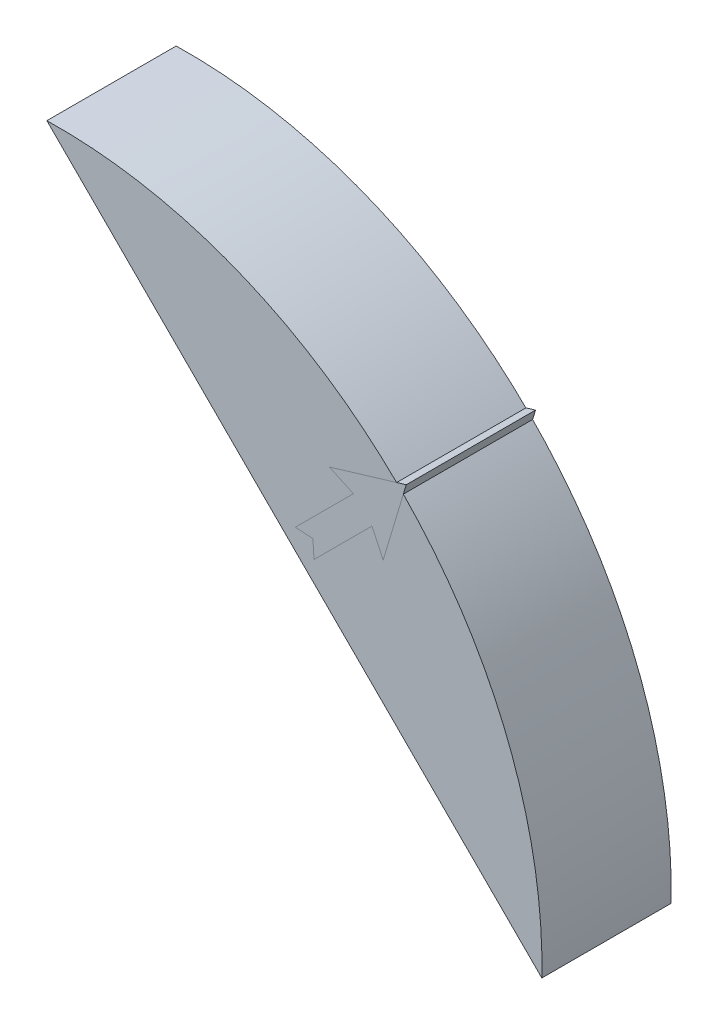
ISO-10303-21;
HEADER;
FILE_DESCRIPTION(('STEP AP214'),'2;1');
FILE_NAME('part.step','',(''),(''),'','','');
FILE_SCHEMA(('AUTOMOTIVE_DESIGN { 1 0 10303 214 1 1 1 1 }'));
ENDSEC;
DATA;
#1=APPLICATION_CONTEXT('core data for automotive mechanical design processes');
#2=APPLICATION_PROTOCOL_DEFINITION('international standard','automotive_design',2000,#1);
#3=PRODUCT_CONTEXT('',#1,'mechanical');
#4=PRODUCT('Part','Part','',(#3));
#5=PRODUCT_RELATED_PRODUCT_CATEGORY('part','',(#4));
#6=PRODUCT_DEFINITION_FORMATION('','',#4);
#7=PRODUCT_DEFINITION_CONTEXT('part definition',#1,'design');
#8=PRODUCT_DEFINITION('design','',#6,#7);
#9=PRODUCT_DEFINITION_SHAPE('','',#8);
#10=(LENGTH_UNIT() NAMED_UNIT(*) SI_UNIT(.MILLI.,.METRE.));
#11=(NAMED_UNIT(*) PLANE_ANGLE_UNIT() SI_UNIT($,.RADIAN.));
#12=(NAMED_UNIT(*) SI_UNIT($,.STERADIAN.) SOLID_ANGLE_UNIT());
#13=UNCERTAINTY_MEASURE_WITH_UNIT(LENGTH_MEASURE(1.E-05),#10,'distance_accuracy_value','');
#14=(GEOMETRIC_REPRESENTATION_CONTEXT(3) GLOBAL_UNCERTAINTY_ASSIGNED_CONTEXT((#13)) GLOBAL_UNIT_ASSIGNED_CONTEXT((#10,
#11,#12)) REPRESENTATION_CONTEXT('',''));
#15=CARTESIAN_POINT('',(0.,0.,0.));
#16=DIRECTION('',(0.,0.,1.));
#17=DIRECTION('',(1.,0.,0.));
#18=AXIS2_PLACEMENT_3D('',#15,#16,#17);
#19=CARTESIAN_POINT('',(0.,0.,1.5));
#20=DIRECTION('',(0.,0.,-1.));
#21=DIRECTION('',(-1.,0.,0.));
#22=AXIS2_PLACEMENT_3D('',#19,#20,#21);
#23=PLANE('',#22);
#24=CARTESIAN_POINT('',(0.,0.,1.5));
#25=DIRECTION('',(0.,0.,-1.));
#26=DIRECTION('',(-1.,0.,0.));
#27=AXIS2_PLACEMENT_3D('',#24,#25,#26);
#28=CIRCLE('',#27,55.086);
#29=CARTESIAN_POINT('',(39.3313377489693,38.5682935437452,1.5));
#30=VERTEX_POINT('',#29);
#31=CARTESIAN_POINT('',(38.5682935437452,39.3313377489694,1.5));
#32=VERTEX_POINT('',#31);
#33=EDGE_CURVE('E62',#30,#32,#28,.F.);
#34=ORIENTED_EDGE('',*,*,#33,.F.);
#35=DIRECTION('',(-0.287592797001998,-0.957752777658498,0.));
#36=VECTOR('',#35,1.);
#37=CARTESIAN_POINT('',(25.4548991008749,-7.64356502073706,1.5));
#38=LINE('',#37,#36);
#39=CARTESIAN_POINT('',(37.0375584183248,30.9294599284331,1.5));
#40=VERTEX_POINT('',#39);
#41=EDGE_CURVE('E120',#30,#40,#38,.T.);
#42=ORIENTED_EDGE('',*,*,#41,.T.);
#43=DIRECTION('',(-0.422618261740696,0.906307787036652,0.));
#44=VECTOR('',#43,1.);
#45=CARTESIAN_POINT('',(42.2690914847563,19.7104010625959,1.5));
#46=LINE('',#45,#44);
#47=CARTESIAN_POINT('',(35.7697036331027,33.6483832895431,1.5));
#48=VERTEX_POINT('',#47);
#49=EDGE_CURVE('E123',#40,#48,#46,.T.);
#50=ORIENTED_EDGE('',*,*,#49,.T.);
#51=DIRECTION('',(-0.707106781186547,-0.707106781186548,0.));
#52=VECTOR('',#51,1.);
#53=CARTESIAN_POINT('',(1.06066017177982,-1.06066017177982,1.5));
#54=LINE('',#53,#52);
#55=CARTESIAN_POINT('',(29.1774350369168,27.0561146933572,1.5));
#56=VERTEX_POINT('',#55);
#57=EDGE_CURVE('E70',#48,#56,#54,.T.);
#58=ORIENTED_EDGE('',*,*,#57,.T.);
#59=DIRECTION('',(-0.0626229125431678,0.998037259236653,0.));
#60=VECTOR('',#59,1.);
#61=CARTESIAN_POINT('',(30.7540191247478,1.92969373856144,1.5));
#62=LINE('',#61,#60);
#63=CARTESIAN_POINT('',(29.0521892118305,29.0521892118305,1.5));
#64=VERTEX_POINT('',#63);
#65=EDGE_CURVE('E108',#56,#64,#62,.T.);
#66=ORIENTED_EDGE('',*,*,#65,.T.);
#67=DIRECTION('',(0.998037259236653,-0.0626229125431678,0.));
#68=VECTOR('',#67,1.);
#69=CARTESIAN_POINT('',(1.92969373856144,30.7540191247479,1.5));
#70=LINE('',#69,#68);
#71=CARTESIAN_POINT('',(27.0561146933572,29.1774350369168,1.5));
#72=VERTEX_POINT('',#71);
#73=EDGE_CURVE('E192',#72,#64,#70,.T.);
#74=ORIENTED_EDGE('',*,*,#73,.F.);
#75=DIRECTION('',(-0.707106781186547,-0.707106781186548,0.));
#76=VECTOR('',#75,1.);
#77=CARTESIAN_POINT('',(-1.06066017177982,1.06066017177982,1.5));
#78=LINE('',#77,#76);
#79=CARTESIAN_POINT('',(33.6483832895431,35.7697036331027,1.5));
#80=VERTEX_POINT('',#79);
#81=EDGE_CURVE('E177',#80,#72,#78,.T.);
#82=ORIENTED_EDGE('',*,*,#81,.F.);
#83=DIRECTION('',(0.906307787036652,-0.422618261740696,0.));
#84=VECTOR('',#83,1.);
#85=CARTESIAN_POINT('',(19.7104010625959,42.2690914847563,1.5));
#86=LINE('',#85,#84);
#87=CARTESIAN_POINT('',(30.9294599284331,37.0375584183248,1.5));
#88=VERTEX_POINT('',#87);
#89=EDGE_CURVE('E191',#88,#80,#86,.T.);
#90=ORIENTED_EDGE('',*,*,#89,.F.);
#91=DIRECTION('',(-0.957752777658498,-0.287592797001998,0.));
#92=VECTOR('',#91,1.);
#93=CARTESIAN_POINT('',(-7.64356502073706,25.4548991008749,1.5));
#94=LINE('',#93,#92);
#95=EDGE_CURVE('E128',#32,#88,#94,.T.);
#96=ORIENTED_EDGE('',*,*,#95,.F.);
#97=EDGE_LOOP('',(#34,#42,#50,#58,#66,#74,#82,#90,#96));
#98=FACE_BOUND('',#97,.T.);
#99=ADVANCED_FACE('F47',(#98),#23,.T.);
#100=CARTESIAN_POINT('',(30.7540191247478,1.92969373856144,1.5));
#101=DIRECTION('',(0.998037259236653,0.0626229125431678,0.));
#102=DIRECTION('',(-0.0626229125431678,0.998037259236653,0.));
#103=AXIS2_PLACEMENT_3D('',#100,#101,#102);
#104=PLANE('',#103);
#105=DIRECTION('',(-0.0626229125431678,0.998037259236653,0.));
#106=VECTOR('',#105,1.);
#107=CARTESIAN_POINT('',(30.7540191247478,1.92969373856144,2.));
#108=LINE('',#107,#106);
#109=CARTESIAN_POINT('',(29.1774350369168,27.0561146933572,2.));
#110=VERTEX_POINT('',#109);
#111=CARTESIAN_POINT('',(29.0521892118305,29.0521892118305,2.));
#112=VERTEX_POINT('',#111);
#113=EDGE_CURVE('E146',#110,#112,#108,.T.);
#114=ORIENTED_EDGE('',*,*,#113,.T.);
#115=DIRECTION('',(0.,0.,1.));
#116=VECTOR('',#115,1.);
#117=CARTESIAN_POINT('',(29.0521892118305,29.0521892118305,1.5));
#118=LINE('',#117,#116);
#119=EDGE_CURVE('E12',#64,#112,#118,.T.);
#120=ORIENTED_EDGE('',*,*,#119,.F.);
#121=ORIENTED_EDGE('',*,*,#65,.F.);
#122=DIRECTION('',(0.,0.,1.));
#123=VECTOR('',#122,1.);
#124=CARTESIAN_POINT('',(29.1774350369168,27.0561146933572,1.5));
#125=LINE('',#124,#123);
#126=EDGE_CURVE('E142',#56,#110,#125,.T.);
#127=ORIENTED_EDGE('',*,*,#126,.T.);
#128=EDGE_LOOP('',(#114,#120,#121,#127));
#129=FACE_BOUND('',#128,.T.);
#130=ADVANCED_FACE('F49',(#129),#104,.F.);
#131=CARTESIAN_POINT('',(1.92969373856144,30.7540191247479,1.5));
#132=DIRECTION('',(-0.0626229125431678,-0.998037259236653,0.));
#133=DIRECTION('',(0.998037259236653,-0.0626229125431678,0.));
#134=AXIS2_PLACEMENT_3D('',#131,#132,#133);
#135=PLANE('',#134);
#136=DIRECTION('',(0.998037259236653,-0.0626229125431678,0.));
#137=VECTOR('',#136,1.);
#138=CARTESIAN_POINT('',(1.92969373856144,30.7540191247479,2.));
#139=LINE('',#138,#137);
#140=CARTESIAN_POINT('',(27.0561146933572,29.1774350369168,2.));
#141=VERTEX_POINT('',#140);
#142=EDGE_CURVE('E149',#141,#112,#139,.T.);
#143=ORIENTED_EDGE('',*,*,#142,.F.);
#144=DIRECTION('',(0.,0.,1.));
#145=VECTOR('',#144,1.);
#146=CARTESIAN_POINT('',(27.0561146933572,29.1774350369168,1.5));
#147=LINE('',#146,#145);
#148=EDGE_CURVE('E55',#72,#141,#147,.T.);
#149=ORIENTED_EDGE('',*,*,#148,.F.);
#150=ORIENTED_EDGE('',*,*,#73,.T.);
#151=ORIENTED_EDGE('',*,*,#119,.T.);
#152=EDGE_LOOP('',(#143,#149,#150,#151));
#153=FACE_BOUND('',#152,.T.);
#154=ADVANCED_FACE('F180',(#153),#135,.T.);
#155=CARTESIAN_POINT('',(-1.06066017177982,1.06066017177982,1.5));
#156=DIRECTION('',(-0.707106781186548,0.707106781186547,0.));
#157=DIRECTION('',(-0.707106781186547,-0.707106781186548,0.));
#158=AXIS2_PLACEMENT_3D('',#155,#156,#157);
#159=PLANE('',#158);
#160=DIRECTION('',(-0.707106781186547,-0.707106781186548,0.));
#161=VECTOR('',#160,1.);
#162=CARTESIAN_POINT('',(-1.06066017177982,1.06066017177982,2.));
#163=LINE('',#162,#161);
#164=CARTESIAN_POINT('',(33.6483832895431,35.7697036331027,2.));
#165=VERTEX_POINT('',#164);
#166=EDGE_CURVE('E152',#165,#141,#163,.T.);
#167=ORIENTED_EDGE('',*,*,#166,.F.);
#168=DIRECTION('',(0.,0.,1.));
#169=VECTOR('',#168,1.);
#170=CARTESIAN_POINT('',(33.6483832895431,35.7697036331027,1.5));
#171=LINE('',#170,#169);
#172=EDGE_CURVE('E170',#80,#165,#171,.T.);
#173=ORIENTED_EDGE('',*,*,#172,.F.);
#174=ORIENTED_EDGE('',*,*,#81,.T.);
#175=ORIENTED_EDGE('',*,*,#148,.T.);
#176=EDGE_LOOP('',(#167,#173,#174,#175));
#177=FACE_BOUND('',#176,.T.);
#178=ADVANCED_FACE('F175',(#177),#159,.T.);
#179=CARTESIAN_POINT('',(19.7104010625959,42.2690914847563,1.5));
#180=DIRECTION('',(-0.422618261740696,-0.906307787036652,0.));
#181=DIRECTION('',(0.906307787036652,-0.422618261740696,0.));
#182=AXIS2_PLACEMENT_3D('',#179,#180,#181);
#183=PLANE('',#182);
#184=DIRECTION('',(0.906307787036652,-0.422618261740696,0.));
#185=VECTOR('',#184,1.);
#186=CARTESIAN_POINT('',(19.7104010625959,42.2690914847563,2.));
#187=LINE('',#186,#185);
#188=CARTESIAN_POINT('',(30.9294599284331,37.0375584183248,2.));
#189=VERTEX_POINT('',#188);
#190=EDGE_CURVE('E155',#189,#165,#187,.T.);
#191=ORIENTED_EDGE('',*,*,#190,.F.);
#192=DIRECTION('',(0.,0.,1.));
#193=VECTOR('',#192,1.);
#194=CARTESIAN_POINT('',(30.9294599284331,37.0375584183248,1.5));
#195=LINE('',#194,#193);
#196=EDGE_CURVE('E168',#88,#189,#195,.T.);
#197=ORIENTED_EDGE('',*,*,#196,.F.);
#198=ORIENTED_EDGE('',*,*,#89,.T.);
#199=ORIENTED_EDGE('',*,*,#172,.T.);
#200=EDGE_LOOP('',(#191,#197,#198,#199));
#201=FACE_BOUND('',#200,.T.);
#202=ADVANCED_FACE('F188',(#201),#183,.T.);
#203=CARTESIAN_POINT('',(-7.64356502073706,25.4548991008749,1.5));
#204=DIRECTION('',(-0.287592797001998,0.957752777658498,0.));
#205=DIRECTION('',(-0.957752777658498,-0.287592797001998,0.));
#206=AXIS2_PLACEMENT_3D('',#203,#204,#205);
#207=PLANE('',#206);
#208=DIRECTION('',(-0.957752777658498,-0.287592797001998,0.));
#209=VECTOR('',#208,1.);
#210=CARTESIAN_POINT('',(-7.64356502073706,25.4548991008749,2.));
#211=LINE('',#210,#209);
#212=CARTESIAN_POINT('',(39.6587909296287,39.6587909296287,2.));
#213=VERTEX_POINT('',#212);
#214=EDGE_CURVE('E158',#213,#189,#211,.T.);
#215=ORIENTED_EDGE('',*,*,#214,.F.);
#216=DIRECTION('',(0.,0.,1.));
#217=VECTOR('',#216,1.);
#218=CARTESIAN_POINT('',(39.6587909296287,39.6587909296287,1.5));
#219=LINE('',#218,#217);
#220=CARTESIAN_POINT('',(39.6587909296287,39.6587909296287,-12.7));
#221=VERTEX_POINT('',#220);
#222=EDGE_CURVE('E137',#221,#213,#219,.T.);
#223=ORIENTED_EDGE('',*,*,#222,.F.);
#224=DIRECTION('',(-0.957752777658498,-0.287592797001998,0.));
#225=VECTOR('',#224,1.);
#226=CARTESIAN_POINT('',(-7.64356502073706,25.4548991008749,-12.7));
#227=LINE('',#226,#225);
#228=CARTESIAN_POINT('',(38.5682935437452,39.3313377489694,-12.7));
#229=VERTEX_POINT('',#228);
#230=EDGE_CURVE('E215',#221,#229,#227,.T.);
#231=ORIENTED_EDGE('',*,*,#230,.T.);
#232=DIRECTION('',(0.,0.,-1.));
#233=VECTOR('',#232,1.);
#234=CARTESIAN_POINT('',(38.5682935437452,39.3313377489694,2.002));
#235=LINE('',#234,#233);
#236=EDGE_CURVE('E202',#32,#229,#235,.T.);
#237=ORIENTED_EDGE('',*,*,#236,.F.);
#238=ORIENTED_EDGE('',*,*,#95,.T.);
#239=ORIENTED_EDGE('',*,*,#196,.T.);
#240=EDGE_LOOP('',(#215,#223,#231,#237,#238,#239));
#241=FACE_BOUND('',#240,.T.);
#242=ADVANCED_FACE('F199',(#241),#207,.T.);
#243=CARTESIAN_POINT('',(25.4548991008749,-7.64356502073706,1.5));
#244=DIRECTION('',(-0.957752777658498,0.287592797001998,0.));
#245=DIRECTION('',(-0.287592797001998,-0.957752777658498,0.));
#246=AXIS2_PLACEMENT_3D('',#243,#244,#245);
#247=PLANE('',#246);
#248=DIRECTION('',(-0.287592797001998,-0.957752777658498,0.));
#249=VECTOR('',#248,1.);
#250=CARTESIAN_POINT('',(25.4548991008749,-7.64356502073706,2.));
#251=LINE('',#250,#249);
#252=CARTESIAN_POINT('',(37.0375584183248,30.9294599284331,2.));
#253=VERTEX_POINT('',#252);
#254=EDGE_CURVE('E134',#213,#253,#251,.T.);
#255=ORIENTED_EDGE('',*,*,#254,.T.);
#256=DIRECTION('',(0.,0.,1.));
#257=VECTOR('',#256,1.);
#258=CARTESIAN_POINT('',(37.0375584183248,30.9294599284331,1.5));
#259=LINE('',#258,#257);
#260=EDGE_CURVE('E131',#40,#253,#259,.T.);
#261=ORIENTED_EDGE('',*,*,#260,.F.);
#262=ORIENTED_EDGE('',*,*,#41,.F.);
#263=DIRECTION('',(0.,0.,-1.));
#264=VECTOR('',#263,1.);
#265=CARTESIAN_POINT('',(39.3313377489693,38.5682935437452,2.002));
#266=LINE('',#265,#264);
#267=CARTESIAN_POINT('',(39.3313377489693,38.5682935437452,-12.7));
#268=VERTEX_POINT('',#267);
#269=EDGE_CURVE('E208',#30,#268,#266,.T.);
#270=ORIENTED_EDGE('',*,*,#269,.T.);
#271=DIRECTION('',(-0.287592797001998,-0.957752777658498,0.));
#272=VECTOR('',#271,1.);
#273=CARTESIAN_POINT('',(25.4548991008749,-7.64356502073706,-12.7));
#274=LINE('',#273,#272);
#275=EDGE_CURVE('E217',#221,#268,#274,.T.);
#276=ORIENTED_EDGE('',*,*,#275,.F.);
#277=ORIENTED_EDGE('',*,*,#222,.T.);
#278=EDGE_LOOP('',(#255,#261,#262,#270,#276,#277));
#279=FACE_BOUND('',#278,.T.);
#280=ADVANCED_FACE('F132',(#279),#247,.F.);
#281=CARTESIAN_POINT('',(42.2690914847563,19.7104010625959,1.5));
#282=DIRECTION('',(0.906307787036652,0.422618261740696,0.));
#283=DIRECTION('',(-0.422618261740696,0.906307787036652,0.));
#284=AXIS2_PLACEMENT_3D('',#281,#282,#283);
#285=PLANE('',#284);
#286=DIRECTION('',(-0.422618261740696,0.906307787036652,0.));
#287=VECTOR('',#286,1.);
#288=CARTESIAN_POINT('',(42.2690914847563,19.7104010625959,2.));
#289=LINE('',#288,#287);
#290=CARTESIAN_POINT('',(35.7697036331027,33.6483832895431,2.));
#291=VERTEX_POINT('',#290);
#292=EDGE_CURVE('E162',#253,#291,#289,.T.);
#293=ORIENTED_EDGE('',*,*,#292,.T.);
#294=DIRECTION('',(0.,0.,1.));
#295=VECTOR('',#294,1.);
#296=CARTESIAN_POINT('',(35.7697036331027,33.6483832895431,1.5));
#297=LINE('',#296,#295);
#298=EDGE_CURVE('E138',#48,#291,#297,.T.);
#299=ORIENTED_EDGE('',*,*,#298,.F.);
#300=ORIENTED_EDGE('',*,*,#49,.F.);
#301=ORIENTED_EDGE('',*,*,#260,.T.);
#302=EDGE_LOOP('',(#293,#299,#300,#301));
#303=FACE_BOUND('',#302,.T.);
#304=ADVANCED_FACE('F140',(#303),#285,.F.);
#305=CARTESIAN_POINT('',(1.06066017177982,-1.06066017177982,1.5));
#306=DIRECTION('',(-0.707106781186548,0.707106781186547,0.));
#307=DIRECTION('',(-0.707106781186547,-0.707106781186548,0.));
#308=AXIS2_PLACEMENT_3D('',#305,#306,#307);
#309=PLANE('',#308);
#310=DIRECTION('',(-0.707106781186547,-0.707106781186548,0.));
#311=VECTOR('',#310,1.);
#312=CARTESIAN_POINT('',(1.06066017177982,-1.06066017177982,2.));
#313=LINE('',#312,#311);
#314=EDGE_CURVE('E102',#291,#110,#313,.T.);
#315=ORIENTED_EDGE('',*,*,#314,.T.);
#316=ORIENTED_EDGE('',*,*,#126,.F.);
#317=ORIENTED_EDGE('',*,*,#57,.F.);
#318=ORIENTED_EDGE('',*,*,#298,.T.);
#319=EDGE_LOOP('',(#315,#316,#317,#318));
#320=FACE_BOUND('',#319,.T.);
#321=ADVANCED_FACE('F228',(#320),#309,.F.);
#322=CARTESIAN_POINT('',(0.,0.,2.));
#323=DIRECTION('',(0.,0.,-1.));
#324=DIRECTION('',(-1.,0.,0.));
#325=AXIS2_PLACEMENT_3D('',#322,#323,#324);
#326=PLANE('',#325);
#327=ORIENTED_EDGE('',*,*,#113,.F.);
#328=ORIENTED_EDGE('',*,*,#314,.F.);
#329=ORIENTED_EDGE('',*,*,#292,.F.);
#330=ORIENTED_EDGE('',*,*,#254,.F.);
#331=ORIENTED_EDGE('',*,*,#214,.T.);
#332=ORIENTED_EDGE('',*,*,#190,.T.);
#333=ORIENTED_EDGE('',*,*,#166,.T.);
#334=ORIENTED_EDGE('',*,*,#142,.T.);
#335=EDGE_LOOP('',(#327,#328,#329,#330,#331,#332,#333,#334));
#336=FACE_BOUND('',#335,.T.);
#337=ADVANCED_FACE('F183',(#336),#326,.F.);
#338=CARTESIAN_POINT('',(0.,0.,2.002));
#339=DIRECTION('',(0.,0.,-1.));
#340=DIRECTION('',(-1.,0.,0.));
#341=AXIS2_PLACEMENT_3D('',#338,#339,#340);
#342=CYLINDRICAL_SURFACE('',#341,55.086);
#343=ORIENTED_EDGE('',*,*,#269,.F.);
#344=ORIENTED_EDGE('',*,*,#33,.T.);
#345=ORIENTED_EDGE('',*,*,#236,.T.);
#346=CARTESIAN_POINT('',(0.,0.,-12.7));
#347=DIRECTION('',(0.,0.,1.));
#348=DIRECTION('',(1.,0.,0.));
#349=AXIS2_PLACEMENT_3D('',#346,#347,#348);
#350=CIRCLE('',#349,55.086);
#351=EDGE_CURVE('E213',#268,#229,#350,.T.);
#352=ORIENTED_EDGE('',*,*,#351,.F.);
#353=EDGE_LOOP('',(#343,#344,#345,#352));
#354=FACE_BOUND('',#353,.T.);
#355=ADVANCED_FACE('F205',(#354),#342,.F.);
#356=CARTESIAN_POINT('',(0.,0.,-12.7));
#357=DIRECTION('',(0.,0.,1.));
#358=DIRECTION('',(1.,0.,0.));
#359=AXIS2_PLACEMENT_3D('',#356,#357,#358);
#360=PLANE('',#359);
#361=ORIENTED_EDGE('',*,*,#275,.T.);
#362=ORIENTED_EDGE('',*,*,#351,.T.);
#363=ORIENTED_EDGE('',*,*,#230,.F.);
#364=EDGE_LOOP('',(#361,#362,#363));
#365=FACE_BOUND('',#364,.T.);
#366=ADVANCED_FACE('F223',(#365),#360,.F.);
#367=CLOSED_SHELL('',(#99,#130,#154,#178,#202,#242,#280,#304,#321,#337,#355,#366));
#368=MANIFOLD_SOLID_BREP('B2',#367);
#369=CARTESIAN_POINT('',(0.,0.,0.));
#370=DIRECTION('',(0.,0.,1.));
#371=DIRECTION('',(1.,0.,0.));
#372=AXIS2_PLACEMENT_3D('',#369,#370,#371);
#373=PLANE('',#372);
#374=DIRECTION('',(0.707106781186548,-0.707106781186547,0.));
#375=VECTOR('',#374,1.);
#376=CARTESIAN_POINT('',(26.9407683632097,26.9407683632097,0.));
#377=LINE('',#376,#375);
#378=CARTESIAN_POINT('',(0.801588995833196,53.0799477305862,0.));
#379=VERTEX_POINT('',#378);
#380=CARTESIAN_POINT('',(53.0799477305862,0.801588995833231,0.));
#381=VERTEX_POINT('',#380);
#382=EDGE_CURVE('E532',#379,#381,#377,.T.);
#383=ORIENTED_EDGE('',*,*,#382,.F.);
#384=CARTESIAN_POINT('',(0.,0.,0.));
#385=DIRECTION('',(0.,0.,1.));
#386=DIRECTION('',(1.,0.,0.));
#387=AXIS2_PLACEMENT_3D('',#384,#385,#386);
#388=CIRCLE('',#387,53.086);
#389=EDGE_CURVE('E518',#379,#381,#388,.F.);
#390=ORIENTED_EDGE('',*,*,#389,.T.);
#391=EDGE_LOOP('',(#383,#390));
#392=FACE_BOUND('',#391,.T.);
#393=ADVANCED_FACE('F357',(#392),#373,.F.);
#394=CARTESIAN_POINT('',(0.,0.,2.));
#395=DIRECTION('',(0.,0.,-1.));
#396=DIRECTION('',(-1.,0.,0.));
#397=AXIS2_PLACEMENT_3D('',#394,#395,#396);
#398=CYLINDRICAL_SURFACE('',#397,55.086);
#399=DIRECTION('',(0.,0.,-1.));
#400=VECTOR('',#399,1.);
#401=CARTESIAN_POINT('',(38.5682935437452,39.3313377489694,2.));
#402=LINE('',#401,#400);
#403=CARTESIAN_POINT('',(38.5682935437452,39.3313377489694,1.5));
#404=VERTEX_POINT('',#403);
#405=CARTESIAN_POINT('',(38.5682935437452,39.3313377489694,2.));
#406=VERTEX_POINT('',#405);
#407=EDGE_CURVE('E516',#404,#406,#402,.F.);
#408=ORIENTED_EDGE('',*,*,#407,.F.);
#409=CARTESIAN_POINT('',(0.,0.,1.5));
#410=DIRECTION('',(0.,0.,-1.));
#411=DIRECTION('',(-1.,0.,0.));
#412=AXIS2_PLACEMENT_3D('',#409,#410,#411);
#413=CIRCLE('',#412,55.086);
#414=CARTESIAN_POINT('',(39.3313377489693,38.5682935437452,1.5));
#415=VERTEX_POINT('',#414);
#416=EDGE_CURVE('E45',#415,#404,#413,.F.);
#417=ORIENTED_EDGE('',*,*,#416,.F.);
#418=DIRECTION('',(0.,0.,-1.));
#419=VECTOR('',#418,1.);
#420=CARTESIAN_POINT('',(39.3313377489693,38.5682935437452,2.));
#421=LINE('',#420,#419);
#422=CARTESIAN_POINT('',(39.3313377489693,38.5682935437452,2.));
#423=VERTEX_POINT('',#422);
#424=EDGE_CURVE('E470',#415,#423,#421,.F.);
#425=ORIENTED_EDGE('',*,*,#424,.T.);
#426=CARTESIAN_POINT('',(0.,0.,2.));
#427=DIRECTION('',(0.,0.,1.));
#428=DIRECTION('',(1.,0.,0.));
#429=AXIS2_PLACEMENT_3D('',#426,#427,#428);
#430=CIRCLE('',#429,55.086);
#431=CARTESIAN_POINT('',(55.0731109247505,-1.19157419833112,2.));
#432=VERTEX_POINT('',#431);
#433=EDGE_CURVE('E538',#423,#432,#430,.F.);
#434=ORIENTED_EDGE('',*,*,#433,.T.);
#435=DIRECTION('',(0.,0.,-1.));
#436=VECTOR('',#435,1.);
#437=CARTESIAN_POINT('',(55.0731109247505,-1.19157419833112,2.));
#438=LINE('',#437,#436);
#439=CARTESIAN_POINT('',(55.0731109247505,-1.19157419833112,-12.7));
#440=VERTEX_POINT('',#439);
#441=EDGE_CURVE('E541',#432,#440,#438,.T.);
#442=ORIENTED_EDGE('',*,*,#441,.T.);
#443=CARTESIAN_POINT('',(0.,0.,-12.7));
#444=DIRECTION('',(0.,0.,1.));
#445=DIRECTION('',(1.,0.,0.));
#446=AXIS2_PLACEMENT_3D('',#443,#444,#445);
#447=CIRCLE('',#446,55.086);
#448=CARTESIAN_POINT('',(-1.19157419833115,55.0731109247505,-12.7));
#449=VERTEX_POINT('',#448);
#450=EDGE_CURVE('E519',#449,#440,#447,.F.);
#451=ORIENTED_EDGE('',*,*,#450,.F.);
#452=DIRECTION('',(0.,0.,-1.));
#453=VECTOR('',#452,1.);
#454=CARTESIAN_POINT('',(-1.19157419833115,55.0731109247505,2.));
#455=LINE('',#454,#453);
#456=CARTESIAN_POINT('',(-1.19157419833115,55.0731109247505,2.));
#457=VERTEX_POINT('',#456);
#458=EDGE_CURVE('E545',#457,#449,#455,.T.);
#459=ORIENTED_EDGE('',*,*,#458,.F.);
#460=EDGE_CURVE('E534',#457,#406,#430,.F.);
#461=ORIENTED_EDGE('',*,*,#460,.T.);
#462=EDGE_LOOP('',(#408,#417,#425,#434,#442,#451,#459,#461));
#463=FACE_BOUND('',#462,.T.);
#464=ADVANCED_FACE('F359',(#463),#398,.T.);
#465=CARTESIAN_POINT('',(26.9407683632097,26.9407683632097,2.));
#466=DIRECTION('',(0.707106781186547,0.707106781186548,0.));
#467=DIRECTION('',(-0.707106781186548,0.707106781186547,0.));
#468=AXIS2_PLACEMENT_3D('',#465,#466,#467);
#469=PLANE('',#468);
#470=ORIENTED_EDGE('',*,*,#458,.T.);
#471=DIRECTION('',(0.707106781186549,-0.707106781186546,0.));
#472=VECTOR('',#471,1.);
#473=CARTESIAN_POINT('',(26.9407683632097,26.9407683632098,-12.7));
#474=LINE('',#473,#472);
#475=CARTESIAN_POINT('',(0.801588995833196,53.0799477305862,-12.7));
#476=VERTEX_POINT('',#475);
#477=EDGE_CURVE('E522',#449,#476,#474,.T.);
#478=ORIENTED_EDGE('',*,*,#477,.T.);
#479=DIRECTION('',(0.,0.,1.));
#480=VECTOR('',#479,1.);
#481=CARTESIAN_POINT('',(0.801588995833196,53.0799477305862,-12.7));
#482=LINE('',#481,#480);
#483=EDGE_CURVE('E529',#476,#379,#482,.T.);
#484=ORIENTED_EDGE('',*,*,#483,.T.);
#485=ORIENTED_EDGE('',*,*,#382,.T.);
#486=DIRECTION('',(0.,0.,1.));
#487=VECTOR('',#486,1.);
#488=CARTESIAN_POINT('',(53.0799477305862,0.801588995833217,-12.7));
#489=LINE('',#488,#487);
#490=CARTESIAN_POINT('',(53.0799477305862,0.801588995833217,-12.7));
#491=VERTEX_POINT('',#490);
#492=EDGE_CURVE('E380',#491,#381,#489,.T.);
#493=ORIENTED_EDGE('',*,*,#492,.F.);
#494=DIRECTION('',(-0.707106781186544,0.707106781186551,0.));
#495=VECTOR('',#494,1.);
#496=CARTESIAN_POINT('',(26.94076836321,26.9407683632097,-12.7));
#497=LINE('',#496,#495);
#498=EDGE_CURVE('E527',#440,#491,#497,.T.);
#499=ORIENTED_EDGE('',*,*,#498,.F.);
#500=ORIENTED_EDGE('',*,*,#441,.F.);
#501=DIRECTION('',(0.707106781186548,-0.707106781186547,0.));
#502=VECTOR('',#501,1.);
#503=CARTESIAN_POINT('',(26.9407683632097,26.9407683632097,2.));
#504=LINE('',#503,#502);
#505=EDGE_CURVE('E537',#457,#432,#504,.T.);
#506=ORIENTED_EDGE('',*,*,#505,.F.);
#507=EDGE_LOOP('',(#470,#478,#484,#485,#493,#499,#500,#506));
#508=FACE_BOUND('',#507,.T.);
#509=ADVANCED_FACE('F574',(#508),#469,.F.);
#510=CARTESIAN_POINT('',(0.,0.,2.));
#511=DIRECTION('',(0.,0.,1.));
#512=DIRECTION('',(1.,0.,0.));
#513=AXIS2_PLACEMENT_3D('',#510,#511,#512);
#514=PLANE('',#513);
#515=DIRECTION('',(-0.957752777658498,-0.287592797001998,0.));
#516=VECTOR('',#515,1.);
#517=CARTESIAN_POINT('',(-7.64356502073706,25.4548991008749,2.));
#518=LINE('',#517,#516);
#519=CARTESIAN_POINT('',(30.9294599284331,37.0375584183248,2.));
#520=VERTEX_POINT('',#519);
#521=EDGE_CURVE('E365',#406,#520,#518,.T.);
#522=ORIENTED_EDGE('',*,*,#521,.F.);
#523=ORIENTED_EDGE('',*,*,#460,.F.);
#524=ORIENTED_EDGE('',*,*,#505,.T.);
#525=ORIENTED_EDGE('',*,*,#433,.F.);
#526=DIRECTION('',(-0.287592797001998,-0.957752777658498,0.));
#527=VECTOR('',#526,1.);
#528=CARTESIAN_POINT('',(25.4548991008749,-7.64356502073706,2.));
#529=LINE('',#528,#527);
#530=CARTESIAN_POINT('',(37.0375584183248,30.9294599284331,2.));
#531=VERTEX_POINT('',#530);
#532=EDGE_CURVE('E547',#423,#531,#529,.T.);
#533=ORIENTED_EDGE('',*,*,#532,.T.);
#534=DIRECTION('',(-0.422618261740696,0.906307787036652,0.));
#535=VECTOR('',#534,1.);
#536=CARTESIAN_POINT('',(42.2690914847563,19.7104010625959,2.));
#537=LINE('',#536,#535);
#538=CARTESIAN_POINT('',(35.7697036331027,33.6483832895431,2.));
#539=VERTEX_POINT('',#538);
#540=EDGE_CURVE('E498',#531,#539,#537,.T.);
#541=ORIENTED_EDGE('',*,*,#540,.T.);
#542=DIRECTION('',(-0.707106781186547,-0.707106781186548,0.));
#543=VECTOR('',#542,1.);
#544=CARTESIAN_POINT('',(1.06066017177982,-1.06066017177982,2.));
#545=LINE('',#544,#543);
#546=CARTESIAN_POINT('',(29.1774350369168,27.0561146933572,2.));
#547=VERTEX_POINT('',#546);
#548=EDGE_CURVE('E462',#539,#547,#545,.T.);
#549=ORIENTED_EDGE('',*,*,#548,.T.);
#550=DIRECTION('',(-0.0626229125431678,0.998037259236653,0.));
#551=VECTOR('',#550,1.);
#552=CARTESIAN_POINT('',(30.7540191247478,1.92969373856144,2.));
#553=LINE('',#552,#551);
#554=CARTESIAN_POINT('',(29.0521892118305,29.0521892118305,2.));
#555=VERTEX_POINT('',#554);
#556=EDGE_CURVE('E372',#547,#555,#553,.T.);
#557=ORIENTED_EDGE('',*,*,#556,.T.);
#558=DIRECTION('',(0.998037259236653,-0.0626229125431678,0.));
#559=VECTOR('',#558,1.);
#560=CARTESIAN_POINT('',(1.92969373856144,30.7540191247479,2.));
#561=LINE('',#560,#559);
#562=CARTESIAN_POINT('',(27.0561146933572,29.1774350369168,2.));
#563=VERTEX_POINT('',#562);
#564=EDGE_CURVE('E469',#563,#555,#561,.T.);
#565=ORIENTED_EDGE('',*,*,#564,.F.);
#566=DIRECTION('',(-0.707106781186547,-0.707106781186548,0.));
#567=VECTOR('',#566,1.);
#568=CARTESIAN_POINT('',(-1.06066017177982,1.06066017177982,2.));
#569=LINE('',#568,#567);
#570=CARTESIAN_POINT('',(33.6483832895431,35.7697036331027,2.));
#571=VERTEX_POINT('',#570);
#572=EDGE_CURVE('E492',#571,#563,#569,.T.);
#573=ORIENTED_EDGE('',*,*,#572,.F.);
#574=DIRECTION('',(0.906307787036652,-0.422618261740696,0.));
#575=VECTOR('',#574,1.);
#576=CARTESIAN_POINT('',(19.7104010625959,42.2690914847563,2.));
#577=LINE('',#576,#575);
#578=EDGE_CURVE('E495',#520,#571,#577,.T.);
#579=ORIENTED_EDGE('',*,*,#578,.F.);
#580=EDGE_LOOP('',(#522,#523,#524,#525,#533,#541,#549,#557,#565,#573,#579));
#581=FACE_BOUND('',#580,.T.);
#582=ADVANCED_FACE('F562',(#581),#514,.T.);
#583=CARTESIAN_POINT('',(0.,0.,-12.7));
#584=DIRECTION('',(0.,0.,1.));
#585=DIRECTION('',(1.,0.,0.));
#586=AXIS2_PLACEMENT_3D('',#583,#584,#585);
#587=CYLINDRICAL_SURFACE('',#586,53.086);
#588=ORIENTED_EDGE('',*,*,#389,.F.);
#589=ORIENTED_EDGE('',*,*,#483,.F.);
#590=CARTESIAN_POINT('',(0.,0.,-12.7));
#591=DIRECTION('',(0.,0.,1.));
#592=DIRECTION('',(1.,0.,0.));
#593=AXIS2_PLACEMENT_3D('',#590,#591,#592);
#594=CIRCLE('',#593,53.086);
#595=EDGE_CURVE('E525',#476,#491,#594,.F.);
#596=ORIENTED_EDGE('',*,*,#595,.T.);
#597=ORIENTED_EDGE('',*,*,#492,.T.);
#598=EDGE_LOOP('',(#588,#589,#596,#597));
#599=FACE_BOUND('',#598,.T.);
#600=ADVANCED_FACE('F608',(#599),#587,.F.);
#601=CARTESIAN_POINT('',(0.,0.,-12.7));
#602=DIRECTION('',(0.,0.,1.));
#603=DIRECTION('',(1.,0.,0.));
#604=AXIS2_PLACEMENT_3D('',#601,#602,#603);
#605=PLANE('',#604);
#606=ORIENTED_EDGE('',*,*,#450,.T.);
#607=ORIENTED_EDGE('',*,*,#498,.T.);
#608=ORIENTED_EDGE('',*,*,#595,.F.);
#609=ORIENTED_EDGE('',*,*,#477,.F.);
#610=EDGE_LOOP('',(#606,#607,#608,#609));
#611=FACE_BOUND('',#610,.T.);
#612=ADVANCED_FACE('F612',(#611),#605,.F.);
#613=CARTESIAN_POINT('',(30.7540191247478,1.92969373856144,1.5));
#614=DIRECTION('',(0.998037259236653,0.0626229125431678,0.));
#615=DIRECTION('',(-0.0626229125431678,0.998037259236653,0.));
#616=AXIS2_PLACEMENT_3D('',#613,#614,#615);
#617=PLANE('',#616);
#618=ORIENTED_EDGE('',*,*,#556,.F.);
#619=DIRECTION('',(0.,0.,1.));
#620=VECTOR('',#619,1.);
#621=CARTESIAN_POINT('',(29.1774350369168,27.0561146933572,1.5));
#622=LINE('',#621,#620);
#623=CARTESIAN_POINT('',(29.1774350369168,27.0561146933572,1.5));
#624=VERTEX_POINT('',#623);
#625=EDGE_CURVE('E457',#624,#547,#622,.T.);
#626=ORIENTED_EDGE('',*,*,#625,.F.);
#627=DIRECTION('',(-0.0626229125431678,0.998037259236653,0.));
#628=VECTOR('',#627,1.);
#629=CARTESIAN_POINT('',(30.7540191247478,1.92969373856144,1.5));
#630=LINE('',#629,#628);
#631=CARTESIAN_POINT('',(29.0521892118305,29.0521892118305,1.5));
#632=VERTEX_POINT('',#631);
#633=EDGE_CURVE('E452',#624,#632,#630,.T.);
#634=ORIENTED_EDGE('',*,*,#633,.T.);
#635=DIRECTION('',(0.,0.,1.));
#636=VECTOR('',#635,1.);
#637=CARTESIAN_POINT('',(29.0521892118305,29.0521892118305,1.5));
#638=LINE('',#637,#636);
#639=EDGE_CURVE('E455',#632,#555,#638,.T.);
#640=ORIENTED_EDGE('',*,*,#639,.T.);
#641=EDGE_LOOP('',(#618,#626,#634,#640));
#642=FACE_BOUND('',#641,.T.);
#643=ADVANCED_FACE('F454',(#642),#617,.T.);
#644=CARTESIAN_POINT('',(1.92969373856144,30.7540191247479,1.5));
#645=DIRECTION('',(-0.0626229125431678,-0.998037259236653,0.));
#646=DIRECTION('',(0.998037259236653,-0.0626229125431678,0.));
#647=AXIS2_PLACEMENT_3D('',#644,#645,#646);
#648=PLANE('',#647);
#649=ORIENTED_EDGE('',*,*,#564,.T.);
#650=ORIENTED_EDGE('',*,*,#639,.F.);
#651=DIRECTION('',(0.998037259236653,-0.0626229125431678,0.));
#652=VECTOR('',#651,1.);
#653=CARTESIAN_POINT('',(1.92969373856144,30.7540191247479,1.5));
#654=LINE('',#653,#652);
#655=CARTESIAN_POINT('',(27.0561146933572,29.1774350369168,1.5));
#656=VERTEX_POINT('',#655);
#657=EDGE_CURVE('E461',#656,#632,#654,.T.);
#658=ORIENTED_EDGE('',*,*,#657,.F.);
#659=DIRECTION('',(0.,0.,1.));
#660=VECTOR('',#659,1.);
#661=CARTESIAN_POINT('',(27.0561146933572,29.1774350369168,1.5));
#662=LINE('',#661,#660);
#663=EDGE_CURVE('E471',#656,#563,#662,.T.);
#664=ORIENTED_EDGE('',*,*,#663,.T.);
#665=EDGE_LOOP('',(#649,#650,#658,#664));
#666=FACE_BOUND('',#665,.T.);
#667=ADVANCED_FACE('F466',(#666),#648,.F.);
#668=CARTESIAN_POINT('',(-1.06066017177982,1.06066017177982,1.5));
#669=DIRECTION('',(-0.707106781186548,0.707106781186547,0.));
#670=DIRECTION('',(-0.707106781186547,-0.707106781186548,0.));
#671=AXIS2_PLACEMENT_3D('',#668,#669,#670);
#672=PLANE('',#671);
#673=ORIENTED_EDGE('',*,*,#572,.T.);
#674=ORIENTED_EDGE('',*,*,#663,.F.);
#675=DIRECTION('',(-0.707106781186547,-0.707106781186548,0.));
#676=VECTOR('',#675,1.);
#677=CARTESIAN_POINT('',(-1.06066017177982,1.06066017177982,1.5));
#678=LINE('',#677,#676);
#679=CARTESIAN_POINT('',(33.6483832895431,35.7697036331027,1.5));
#680=VERTEX_POINT('',#679);
#681=EDGE_CURVE('E476',#680,#656,#678,.T.);
#682=ORIENTED_EDGE('',*,*,#681,.F.);
#683=DIRECTION('',(0.,0.,1.));
#684=VECTOR('',#683,1.);
#685=CARTESIAN_POINT('',(33.6483832895431,35.7697036331027,1.5));
#686=LINE('',#685,#684);
#687=EDGE_CURVE('E511',#680,#571,#686,.T.);
#688=ORIENTED_EDGE('',*,*,#687,.T.);
#689=EDGE_LOOP('',(#673,#674,#682,#688));
#690=FACE_BOUND('',#689,.T.);
#691=ADVANCED_FACE('F564',(#690),#672,.F.);
#692=CARTESIAN_POINT('',(19.7104010625959,42.2690914847563,1.5));
#693=DIRECTION('',(-0.422618261740696,-0.906307787036652,0.));
#694=DIRECTION('',(0.906307787036652,-0.422618261740696,0.));
#695=AXIS2_PLACEMENT_3D('',#692,#693,#694);
#696=PLANE('',#695);
#697=ORIENTED_EDGE('',*,*,#578,.T.);
#698=ORIENTED_EDGE('',*,*,#687,.F.);
#699=DIRECTION('',(0.906307787036652,-0.422618261740696,0.));
#700=VECTOR('',#699,1.);
#701=CARTESIAN_POINT('',(19.7104010625959,42.2690914847563,1.5));
#702=LINE('',#701,#700);
#703=CARTESIAN_POINT('',(30.9294599284331,37.0375584183248,1.5));
#704=VERTEX_POINT('',#703);
#705=EDGE_CURVE('E478',#704,#680,#702,.T.);
#706=ORIENTED_EDGE('',*,*,#705,.F.);
#707=DIRECTION('',(0.,0.,1.));
#708=VECTOR('',#707,1.);
#709=CARTESIAN_POINT('',(30.9294599284331,37.0375584183248,1.5));
#710=LINE('',#709,#708);
#711=EDGE_CURVE('E508',#704,#520,#710,.T.);
#712=ORIENTED_EDGE('',*,*,#711,.T.);
#713=EDGE_LOOP('',(#697,#698,#706,#712));
#714=FACE_BOUND('',#713,.T.);
#715=ADVANCED_FACE('F560',(#714),#696,.F.);
#716=CARTESIAN_POINT('',(-7.64356502073706,25.4548991008749,1.5));
#717=DIRECTION('',(-0.287592797001998,0.957752777658498,0.));
#718=DIRECTION('',(-0.957752777658498,-0.287592797001998,0.));
#719=AXIS2_PLACEMENT_3D('',#716,#717,#718);
#720=PLANE('',#719);
#721=ORIENTED_EDGE('',*,*,#407,.T.);
#722=ORIENTED_EDGE('',*,*,#521,.T.);
#723=ORIENTED_EDGE('',*,*,#711,.F.);
#724=DIRECTION('',(-0.957752777658498,-0.287592797001998,0.));
#725=VECTOR('',#724,1.);
#726=CARTESIAN_POINT('',(-7.64356502073706,25.4548991008749,1.5));
#727=LINE('',#726,#725);
#728=EDGE_CURVE('E482',#404,#704,#727,.T.);
#729=ORIENTED_EDGE('',*,*,#728,.F.);
#730=EDGE_LOOP('',(#721,#722,#723,#729));
#731=FACE_BOUND('',#730,.T.);
#732=ADVANCED_FACE('F552',(#731),#720,.F.);
#733=CARTESIAN_POINT('',(25.4548991008749,-7.64356502073706,1.5));
#734=DIRECTION('',(-0.957752777658498,0.287592797001998,0.));
#735=DIRECTION('',(-0.287592797001998,-0.957752777658498,0.));
#736=AXIS2_PLACEMENT_3D('',#733,#734,#735);
#737=PLANE('',#736);
#738=DIRECTION('',(-0.287592797001998,-0.957752777658498,0.));
#739=VECTOR('',#738,1.);
#740=CARTESIAN_POINT('',(25.4548991008749,-7.64356502073706,1.5));
#741=LINE('',#740,#739);
#742=CARTESIAN_POINT('',(37.0375584183248,30.9294599284331,1.5));
#743=VERTEX_POINT('',#742);
#744=EDGE_CURVE('E484',#415,#743,#741,.T.);
#745=ORIENTED_EDGE('',*,*,#744,.T.);
#746=DIRECTION('',(0.,0.,1.));
#747=VECTOR('',#746,1.);
#748=CARTESIAN_POINT('',(37.0375584183248,30.9294599284331,1.5));
#749=LINE('',#748,#747);
#750=EDGE_CURVE('E506',#743,#531,#749,.T.);
#751=ORIENTED_EDGE('',*,*,#750,.T.);
#752=ORIENTED_EDGE('',*,*,#532,.F.);
#753=ORIENTED_EDGE('',*,*,#424,.F.);
#754=EDGE_LOOP('',(#745,#751,#752,#753));
#755=FACE_BOUND('',#754,.T.);
#756=ADVANCED_FACE('F577',(#755),#737,.T.);
#757=CARTESIAN_POINT('',(42.2690914847563,19.7104010625959,1.5));
#758=DIRECTION('',(0.906307787036652,0.422618261740696,0.));
#759=DIRECTION('',(-0.422618261740696,0.906307787036652,0.));
#760=AXIS2_PLACEMENT_3D('',#757,#758,#759);
#761=PLANE('',#760);
#762=ORIENTED_EDGE('',*,*,#540,.F.);
#763=ORIENTED_EDGE('',*,*,#750,.F.);
#764=DIRECTION('',(-0.422618261740696,0.906307787036652,0.));
#765=VECTOR('',#764,1.);
#766=CARTESIAN_POINT('',(42.2690914847563,19.7104010625959,1.5));
#767=LINE('',#766,#765);
#768=CARTESIAN_POINT('',(35.7697036331027,33.6483832895431,1.5));
#769=VERTEX_POINT('',#768);
#770=EDGE_CURVE('E486',#743,#769,#767,.T.);
#771=ORIENTED_EDGE('',*,*,#770,.T.);
#772=DIRECTION('',(0.,0.,1.));
#773=VECTOR('',#772,1.);
#774=CARTESIAN_POINT('',(35.7697036331027,33.6483832895431,1.5));
#775=LINE('',#774,#773);
#776=EDGE_CURVE('E504',#769,#539,#775,.T.);
#777=ORIENTED_EDGE('',*,*,#776,.T.);
#778=EDGE_LOOP('',(#762,#763,#771,#777));
#779=FACE_BOUND('',#778,.T.);
#780=ADVANCED_FACE('F583',(#779),#761,.T.);
#781=CARTESIAN_POINT('',(1.06066017177982,-1.06066017177982,1.5));
#782=DIRECTION('',(-0.707106781186548,0.707106781186547,0.));
#783=DIRECTION('',(-0.707106781186547,-0.707106781186548,0.));
#784=AXIS2_PLACEMENT_3D('',#781,#782,#783);
#785=PLANE('',#784);
#786=ORIENTED_EDGE('',*,*,#548,.F.);
#787=ORIENTED_EDGE('',*,*,#776,.F.);
#788=DIRECTION('',(-0.707106781186547,-0.707106781186548,0.));
#789=VECTOR('',#788,1.);
#790=CARTESIAN_POINT('',(1.06066017177982,-1.06066017177982,1.5));
#791=LINE('',#790,#789);
#792=EDGE_CURVE('E488',#769,#624,#791,.T.);
#793=ORIENTED_EDGE('',*,*,#792,.T.);
#794=ORIENTED_EDGE('',*,*,#625,.T.);
#795=EDGE_LOOP('',(#786,#787,#793,#794));
#796=FACE_BOUND('',#795,.T.);
#797=ADVANCED_FACE('F586',(#796),#785,.T.);
#798=CARTESIAN_POINT('',(0.,0.,1.5));
#799=DIRECTION('',(0.,0.,-1.));
#800=DIRECTION('',(-1.,0.,0.));
#801=AXIS2_PLACEMENT_3D('',#798,#799,#800);
#802=PLANE('',#801);
#803=ORIENTED_EDGE('',*,*,#416,.T.);
#804=ORIENTED_EDGE('',*,*,#728,.T.);
#805=ORIENTED_EDGE('',*,*,#705,.T.);
#806=ORIENTED_EDGE('',*,*,#681,.T.);
#807=ORIENTED_EDGE('',*,*,#657,.T.);
#808=ORIENTED_EDGE('',*,*,#633,.F.);
#809=ORIENTED_EDGE('',*,*,#792,.F.);
#810=ORIENTED_EDGE('',*,*,#770,.F.);
#811=ORIENTED_EDGE('',*,*,#744,.F.);
#812=EDGE_LOOP('',(#803,#804,#805,#806,#807,#808,#809,#810,#811));
#813=FACE_BOUND('',#812,.T.);
#814=ADVANCED_FACE('F473',(#813),#802,.F.);
#815=CLOSED_SHELL('',(#393,#464,#509,#582,#600,#612,#643,#667,#691,#715,#732,#756,#780,#797,#814));
#816=MANIFOLD_SOLID_BREP('B6',#815);
#817=ADVANCED_BREP_SHAPE_REPRESENTATION('',(#18,#368,#816),#14);
#818=SHAPE_DEFINITION_REPRESENTATION(#9,#817);
ENDSEC;
END-ISO-10303-21;
